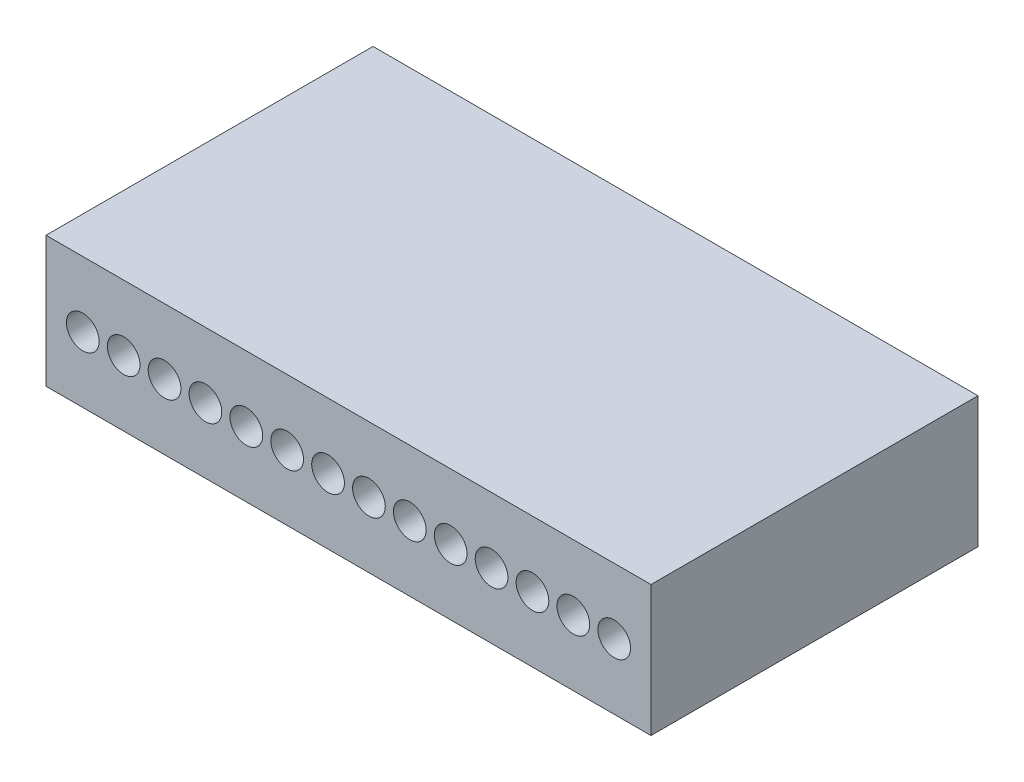
ISO-10303-21;
HEADER;
FILE_DESCRIPTION(('STEP AP214'),'2;1');
FILE_NAME('part.step','',(''),(''),'','','');
FILE_SCHEMA(('AUTOMOTIVE_DESIGN { 1 0 10303 214 1 1 1 1 }'));
ENDSEC;
DATA;
#1=APPLICATION_CONTEXT('core data for automotive mechanical design processes');
#2=APPLICATION_PROTOCOL_DEFINITION('international standard','automotive_design',2000,#1);
#3=PRODUCT_CONTEXT('',#1,'mechanical');
#4=PRODUCT('Part','Part','',(#3));
#5=PRODUCT_RELATED_PRODUCT_CATEGORY('part','',(#4));
#6=PRODUCT_DEFINITION_FORMATION('','',#4);
#7=PRODUCT_DEFINITION_CONTEXT('part definition',#1,'design');
#8=PRODUCT_DEFINITION('design','',#6,#7);
#9=PRODUCT_DEFINITION_SHAPE('','',#8);
#10=(LENGTH_UNIT() NAMED_UNIT(*) SI_UNIT(.MILLI.,.METRE.));
#11=(NAMED_UNIT(*) PLANE_ANGLE_UNIT() SI_UNIT($,.RADIAN.));
#12=(NAMED_UNIT(*) SI_UNIT($,.STERADIAN.) SOLID_ANGLE_UNIT());
#13=UNCERTAINTY_MEASURE_WITH_UNIT(LENGTH_MEASURE(1.E-05),#10,'distance_accuracy_value','');
#14=(GEOMETRIC_REPRESENTATION_CONTEXT(3) GLOBAL_UNCERTAINTY_ASSIGNED_CONTEXT((#13)) GLOBAL_UNIT_ASSIGNED_CONTEXT((#10,
#11,#12)) REPRESENTATION_CONTEXT('',''));
#15=CARTESIAN_POINT('',(0.,0.,0.));
#16=DIRECTION('',(0.,0.,1.));
#17=DIRECTION('',(1.,0.,0.));
#18=AXIS2_PLACEMENT_3D('',#15,#16,#17);
#19=CARTESIAN_POINT('',(0.,0.,10.));
#20=DIRECTION('',(1.,0.,0.));
#21=DIRECTION('',(0.,0.,-1.));
#22=AXIS2_PLACEMENT_3D('',#19,#20,#21);
#23=PLANE('',#22);
#24=DIRECTION('',(0.,-1.,0.));
#25=VECTOR('',#24,1.);
#26=CARTESIAN_POINT('',(0.,0.,0.));
#27=LINE('',#26,#25);
#28=CARTESIAN_POINT('',(0.,4.,0.));
#29=VERTEX_POINT('',#28);
#30=CARTESIAN_POINT('',(0.,0.,0.));
#31=VERTEX_POINT('',#30);
#32=EDGE_CURVE('E107',#29,#31,#27,.T.);
#33=ORIENTED_EDGE('',*,*,#32,.T.);
#34=DIRECTION('',(0.,0.,-1.));
#35=VECTOR('',#34,1.);
#36=CARTESIAN_POINT('',(0.,0.,10.));
#37=LINE('',#36,#35);
#38=CARTESIAN_POINT('',(0.,0.,10.));
#39=VERTEX_POINT('',#38);
#40=EDGE_CURVE('E11',#39,#31,#37,.T.);
#41=ORIENTED_EDGE('',*,*,#40,.F.);
#42=DIRECTION('',(0.,-1.,0.));
#43=VECTOR('',#42,1.);
#44=CARTESIAN_POINT('',(0.,0.,10.));
#45=LINE('',#44,#43);
#46=CARTESIAN_POINT('',(0.,4.,10.));
#47=VERTEX_POINT('',#46);
#48=EDGE_CURVE('E91',#47,#39,#45,.T.);
#49=ORIENTED_EDGE('',*,*,#48,.F.);
#50=DIRECTION('',(0.,0.,-1.));
#51=VECTOR('',#50,1.);
#52=CARTESIAN_POINT('',(0.,4.,10.));
#53=LINE('',#52,#51);
#54=EDGE_CURVE('E103',#47,#29,#53,.T.);
#55=ORIENTED_EDGE('',*,*,#54,.T.);
#56=EDGE_LOOP('',(#33,#41,#49,#55));
#57=FACE_BOUND('',#56,.T.);
#58=ADVANCED_FACE('F39',(#57),#23,.F.);
#59=CARTESIAN_POINT('',(0.,0.,10.));
#60=DIRECTION('',(0.,1.,0.));
#61=DIRECTION('',(0.,0.,1.));
#62=AXIS2_PLACEMENT_3D('',#59,#60,#61);
#63=PLANE('',#62);
#64=DIRECTION('',(1.,0.,0.));
#65=VECTOR('',#64,1.);
#66=CARTESIAN_POINT('',(0.,0.,0.));
#67=LINE('',#66,#65);
#68=CARTESIAN_POINT('',(18.5,0.,0.));
#69=VERTEX_POINT('',#68);
#70=EDGE_CURVE('E96',#31,#69,#67,.T.);
#71=ORIENTED_EDGE('',*,*,#70,.T.);
#72=DIRECTION('',(0.,0.,-1.));
#73=VECTOR('',#72,1.);
#74=CARTESIAN_POINT('',(18.5,0.,10.));
#75=LINE('',#74,#73);
#76=CARTESIAN_POINT('',(18.5,0.,10.));
#77=VERTEX_POINT('',#76);
#78=EDGE_CURVE('E48',#77,#69,#75,.T.);
#79=ORIENTED_EDGE('',*,*,#78,.F.);
#80=DIRECTION('',(1.,0.,0.));
#81=VECTOR('',#80,1.);
#82=CARTESIAN_POINT('',(0.,0.,10.));
#83=LINE('',#82,#81);
#84=EDGE_CURVE('E86',#39,#77,#83,.T.);
#85=ORIENTED_EDGE('',*,*,#84,.F.);
#86=ORIENTED_EDGE('',*,*,#40,.T.);
#87=EDGE_LOOP('',(#71,#79,#85,#86));
#88=FACE_BOUND('',#87,.T.);
#89=ADVANCED_FACE('F95',(#88),#63,.F.);
#90=CARTESIAN_POINT('',(18.5,0.,10.));
#91=DIRECTION('',(-1.,0.,0.));
#92=DIRECTION('',(0.,0.,1.));
#93=AXIS2_PLACEMENT_3D('',#90,#91,#92);
#94=PLANE('',#93);
#95=DIRECTION('',(0.,1.,0.));
#96=VECTOR('',#95,1.);
#97=CARTESIAN_POINT('',(18.5,0.,0.));
#98=LINE('',#97,#96);
#99=CARTESIAN_POINT('',(18.5,4.,0.));
#100=VERTEX_POINT('',#99);
#101=EDGE_CURVE('E73',#69,#100,#98,.T.);
#102=ORIENTED_EDGE('',*,*,#101,.T.);
#103=DIRECTION('',(0.,0.,-1.));
#104=VECTOR('',#103,1.);
#105=CARTESIAN_POINT('',(18.5,4.,10.));
#106=LINE('',#105,#104);
#107=CARTESIAN_POINT('',(18.5,4.,10.));
#108=VERTEX_POINT('',#107);
#109=EDGE_CURVE('E98',#108,#100,#106,.T.);
#110=ORIENTED_EDGE('',*,*,#109,.F.);
#111=DIRECTION('',(0.,1.,0.));
#112=VECTOR('',#111,1.);
#113=CARTESIAN_POINT('',(18.5,0.,10.));
#114=LINE('',#113,#112);
#115=EDGE_CURVE('E89',#77,#108,#114,.T.);
#116=ORIENTED_EDGE('',*,*,#115,.F.);
#117=ORIENTED_EDGE('',*,*,#78,.T.);
#118=EDGE_LOOP('',(#102,#110,#116,#117));
#119=FACE_BOUND('',#118,.T.);
#120=ADVANCED_FACE('F99',(#119),#94,.F.);
#121=CARTESIAN_POINT('',(0.,4.,10.));
#122=DIRECTION('',(0.,-1.,0.));
#123=DIRECTION('',(0.,0.,-1.));
#124=AXIS2_PLACEMENT_3D('',#121,#122,#123);
#125=PLANE('',#124);
#126=DIRECTION('',(-1.,0.,0.));
#127=VECTOR('',#126,1.);
#128=CARTESIAN_POINT('',(0.,4.,0.));
#129=LINE('',#128,#127);
#130=EDGE_CURVE('E79',#100,#29,#129,.T.);
#131=ORIENTED_EDGE('',*,*,#130,.T.);
#132=ORIENTED_EDGE('',*,*,#54,.F.);
#133=DIRECTION('',(-1.,0.,0.));
#134=VECTOR('',#133,1.);
#135=CARTESIAN_POINT('',(0.,4.,10.));
#136=LINE('',#135,#134);
#137=EDGE_CURVE('E56',#108,#47,#136,.T.);
#138=ORIENTED_EDGE('',*,*,#137,.F.);
#139=ORIENTED_EDGE('',*,*,#109,.T.);
#140=EDGE_LOOP('',(#131,#132,#138,#139));
#141=FACE_BOUND('',#140,.T.);
#142=ADVANCED_FACE('F121',(#141),#125,.F.);
#143=CARTESIAN_POINT('',(0.,0.,10.));
#144=DIRECTION('',(0.,0.,-1.));
#145=DIRECTION('',(-1.,0.,0.));
#146=AXIS2_PLACEMENT_3D('',#143,#144,#145);
#147=PLANE('',#146);
#148=CARTESIAN_POINT('',(1.125,2.,10.));
#149=DIRECTION('',(0.,0.,1.));
#150=DIRECTION('',(1.,0.,0.));
#151=AXIS2_PLACEMENT_3D('',#148,#149,#150);
#152=CIRCLE('',#151,0.5);
#153=CARTESIAN_POINT('',(1.625,2.,10.));
#154=VERTEX_POINT('',#153);
#155=EDGE_CURVE('E232',#154,#154,#152,.T.);
#156=ORIENTED_EDGE('',*,*,#155,.F.);
#157=EDGE_LOOP('',(#156));
#158=FACE_BOUND('',#157,.T.);
#159=CARTESIAN_POINT('',(2.375,2.,10.));
#160=DIRECTION('',(0.,0.,1.));
#161=DIRECTION('',(1.,0.,0.));
#162=AXIS2_PLACEMENT_3D('',#159,#160,#161);
#163=CIRCLE('',#162,0.5);
#164=CARTESIAN_POINT('',(2.875,2.,10.));
#165=VERTEX_POINT('',#164);
#166=EDGE_CURVE('E224',#165,#165,#163,.T.);
#167=ORIENTED_EDGE('',*,*,#166,.F.);
#168=EDGE_LOOP('',(#167));
#169=FACE_BOUND('',#168,.T.);
#170=CARTESIAN_POINT('',(3.625,2.,10.));
#171=DIRECTION('',(0.,0.,1.));
#172=DIRECTION('',(1.,0.,0.));
#173=AXIS2_PLACEMENT_3D('',#170,#171,#172);
#174=CIRCLE('',#173,0.5);
#175=CARTESIAN_POINT('',(4.125,2.,10.));
#176=VERTEX_POINT('',#175);
#177=EDGE_CURVE('E216',#176,#176,#174,.T.);
#178=ORIENTED_EDGE('',*,*,#177,.F.);
#179=EDGE_LOOP('',(#178));
#180=FACE_BOUND('',#179,.T.);
#181=CARTESIAN_POINT('',(4.875,2.,10.));
#182=DIRECTION('',(0.,0.,1.));
#183=DIRECTION('',(1.,0.,0.));
#184=AXIS2_PLACEMENT_3D('',#181,#182,#183);
#185=CIRCLE('',#184,0.5);
#186=CARTESIAN_POINT('',(5.375,2.,10.));
#187=VERTEX_POINT('',#186);
#188=EDGE_CURVE('E208',#187,#187,#185,.T.);
#189=ORIENTED_EDGE('',*,*,#188,.F.);
#190=EDGE_LOOP('',(#189));
#191=FACE_BOUND('',#190,.T.);
#192=CARTESIAN_POINT('',(6.125,2.,10.));
#193=DIRECTION('',(0.,0.,1.));
#194=DIRECTION('',(1.,0.,0.));
#195=AXIS2_PLACEMENT_3D('',#192,#193,#194);
#196=CIRCLE('',#195,0.5);
#197=CARTESIAN_POINT('',(6.625,2.,10.));
#198=VERTEX_POINT('',#197);
#199=EDGE_CURVE('E200',#198,#198,#196,.T.);
#200=ORIENTED_EDGE('',*,*,#199,.F.);
#201=EDGE_LOOP('',(#200));
#202=FACE_BOUND('',#201,.T.);
#203=CARTESIAN_POINT('',(7.375,2.,10.));
#204=DIRECTION('',(0.,0.,1.));
#205=DIRECTION('',(1.,0.,0.));
#206=AXIS2_PLACEMENT_3D('',#203,#204,#205);
#207=CIRCLE('',#206,0.500000000000002);
#208=CARTESIAN_POINT('',(7.875,2.,10.));
#209=VERTEX_POINT('',#208);
#210=EDGE_CURVE('E192',#209,#209,#207,.T.);
#211=ORIENTED_EDGE('',*,*,#210,.F.);
#212=EDGE_LOOP('',(#211));
#213=FACE_BOUND('',#212,.T.);
#214=CARTESIAN_POINT('',(8.625,2.,10.));
#215=DIRECTION('',(0.,0.,1.));
#216=DIRECTION('',(1.,0.,0.));
#217=AXIS2_PLACEMENT_3D('',#214,#215,#216);
#218=CIRCLE('',#217,0.499999999999999);
#219=CARTESIAN_POINT('',(9.125,2.,10.));
#220=VERTEX_POINT('',#219);
#221=EDGE_CURVE('E184',#220,#220,#218,.T.);
#222=ORIENTED_EDGE('',*,*,#221,.F.);
#223=EDGE_LOOP('',(#222));
#224=FACE_BOUND('',#223,.T.);
#225=CARTESIAN_POINT('',(9.875,2.,10.));
#226=DIRECTION('',(0.,0.,1.));
#227=DIRECTION('',(1.,0.,0.));
#228=AXIS2_PLACEMENT_3D('',#225,#226,#227);
#229=CIRCLE('',#228,0.499999999999999);
#230=CARTESIAN_POINT('',(10.375,2.,10.));
#231=VERTEX_POINT('',#230);
#232=EDGE_CURVE('E176',#231,#231,#229,.T.);
#233=ORIENTED_EDGE('',*,*,#232,.F.);
#234=EDGE_LOOP('',(#233));
#235=FACE_BOUND('',#234,.T.);
#236=CARTESIAN_POINT('',(11.125,2.,10.));
#237=DIRECTION('',(0.,0.,1.));
#238=DIRECTION('',(1.,0.,0.));
#239=AXIS2_PLACEMENT_3D('',#236,#237,#238);
#240=CIRCLE('',#239,0.499999999999999);
#241=CARTESIAN_POINT('',(11.625,2.,10.));
#242=VERTEX_POINT('',#241);
#243=EDGE_CURVE('E168',#242,#242,#240,.T.);
#244=ORIENTED_EDGE('',*,*,#243,.F.);
#245=EDGE_LOOP('',(#244));
#246=FACE_BOUND('',#245,.T.);
#247=CARTESIAN_POINT('',(12.375,2.,10.));
#248=DIRECTION('',(0.,0.,1.));
#249=DIRECTION('',(1.,0.,0.));
#250=AXIS2_PLACEMENT_3D('',#247,#248,#249);
#251=CIRCLE('',#250,0.499999999999999);
#252=CARTESIAN_POINT('',(12.875,2.,10.));
#253=VERTEX_POINT('',#252);
#254=EDGE_CURVE('E160',#253,#253,#251,.T.);
#255=ORIENTED_EDGE('',*,*,#254,.F.);
#256=EDGE_LOOP('',(#255));
#257=FACE_BOUND('',#256,.T.);
#258=CARTESIAN_POINT('',(13.625,2.,10.));
#259=DIRECTION('',(0.,0.,1.));
#260=DIRECTION('',(1.,0.,0.));
#261=AXIS2_PLACEMENT_3D('',#258,#259,#260);
#262=CIRCLE('',#261,0.499999999999999);
#263=CARTESIAN_POINT('',(14.125,2.,10.));
#264=VERTEX_POINT('',#263);
#265=EDGE_CURVE('E152',#264,#264,#262,.T.);
#266=ORIENTED_EDGE('',*,*,#265,.F.);
#267=EDGE_LOOP('',(#266));
#268=FACE_BOUND('',#267,.T.);
#269=CARTESIAN_POINT('',(14.875,2.,10.));
#270=DIRECTION('',(0.,0.,1.));
#271=DIRECTION('',(1.,0.,0.));
#272=AXIS2_PLACEMENT_3D('',#269,#270,#271);
#273=CIRCLE('',#272,0.499999999999999);
#274=CARTESIAN_POINT('',(15.375,2.,10.));
#275=VERTEX_POINT('',#274);
#276=EDGE_CURVE('E144',#275,#275,#273,.T.);
#277=ORIENTED_EDGE('',*,*,#276,.F.);
#278=EDGE_LOOP('',(#277));
#279=FACE_BOUND('',#278,.T.);
#280=CARTESIAN_POINT('',(16.125,2.,10.));
#281=DIRECTION('',(0.,0.,1.));
#282=DIRECTION('',(1.,0.,0.));
#283=AXIS2_PLACEMENT_3D('',#280,#281,#282);
#284=CIRCLE('',#283,0.499999999999999);
#285=CARTESIAN_POINT('',(16.625,2.,10.));
#286=VERTEX_POINT('',#285);
#287=EDGE_CURVE('E136',#286,#286,#284,.T.);
#288=ORIENTED_EDGE('',*,*,#287,.F.);
#289=EDGE_LOOP('',(#288));
#290=FACE_BOUND('',#289,.T.);
#291=CARTESIAN_POINT('',(17.375,2.,10.));
#292=DIRECTION('',(0.,0.,1.));
#293=DIRECTION('',(1.,0.,0.));
#294=AXIS2_PLACEMENT_3D('',#291,#292,#293);
#295=CIRCLE('',#294,0.499999999999999);
#296=CARTESIAN_POINT('',(17.875,2.,10.));
#297=VERTEX_POINT('',#296);
#298=EDGE_CURVE('E128',#297,#297,#295,.T.);
#299=ORIENTED_EDGE('',*,*,#298,.F.);
#300=EDGE_LOOP('',(#299));
#301=FACE_BOUND('',#300,.T.);
#302=ORIENTED_EDGE('',*,*,#48,.T.);
#303=ORIENTED_EDGE('',*,*,#84,.T.);
#304=ORIENTED_EDGE('',*,*,#115,.T.);
#305=ORIENTED_EDGE('',*,*,#137,.T.);
#306=EDGE_LOOP('',(#302,#303,#304,#305));
#307=FACE_BOUND('',#306,.T.);
#308=ADVANCED_FACE('F87',(#158,#169,#180,#191,#202,#213,#224,#235,#246,#257,#268,#279,#290,#301,
#307),#147,.F.);
#309=CARTESIAN_POINT('',(0.,0.,0.));
#310=DIRECTION('',(0.,0.,-1.));
#311=DIRECTION('',(-1.,0.,0.));
#312=AXIS2_PLACEMENT_3D('',#309,#310,#311);
#313=PLANE('',#312);
#314=ORIENTED_EDGE('',*,*,#32,.F.);
#315=ORIENTED_EDGE('',*,*,#130,.F.);
#316=ORIENTED_EDGE('',*,*,#101,.F.);
#317=ORIENTED_EDGE('',*,*,#70,.F.);
#318=EDGE_LOOP('',(#314,#315,#316,#317));
#319=FACE_BOUND('',#318,.T.);
#320=ADVANCED_FACE('F124',(#319),#313,.T.);
#321=CARTESIAN_POINT('',(17.375,2.,5.));
#322=DIRECTION('',(0.,0.,1.));
#323=DIRECTION('',(1.,0.,0.));
#324=AXIS2_PLACEMENT_3D('',#321,#322,#323);
#325=CYLINDRICAL_SURFACE('',#324,0.499999999999999);
#326=CARTESIAN_POINT('',(17.375,2.,5.));
#327=DIRECTION('',(0.,0.,1.));
#328=DIRECTION('',(1.,0.,0.));
#329=AXIS2_PLACEMENT_3D('',#326,#327,#328);
#330=CIRCLE('',#329,0.499999999999999);
#331=CARTESIAN_POINT('',(17.875,2.,5.));
#332=VERTEX_POINT('',#331);
#333=EDGE_CURVE('E132',#332,#332,#330,.T.);
#334=ORIENTED_EDGE('',*,*,#333,.F.);
#335=EDGE_LOOP('',(#334));
#336=FACE_BOUND('',#335,.T.);
#337=ORIENTED_EDGE('',*,*,#298,.T.);
#338=EDGE_LOOP('',(#337));
#339=FACE_BOUND('',#338,.T.);
#340=ADVANCED_FACE('F278',(#336,#339),#325,.F.);
#341=CARTESIAN_POINT('',(17.375,2.,5.));
#342=DIRECTION('',(0.,0.,1.));
#343=DIRECTION('',(1.,0.,0.));
#344=AXIS2_PLACEMENT_3D('',#341,#342,#343);
#345=PLANE('',#344);
#346=ORIENTED_EDGE('',*,*,#333,.T.);
#347=EDGE_LOOP('',(#346));
#348=FACE_BOUND('',#347,.T.);
#349=ADVANCED_FACE('F280',(#348),#345,.T.);
#350=CARTESIAN_POINT('',(16.125,2.,5.));
#351=DIRECTION('',(0.,0.,1.));
#352=DIRECTION('',(1.,0.,0.));
#353=AXIS2_PLACEMENT_3D('',#350,#351,#352);
#354=CYLINDRICAL_SURFACE('',#353,0.499999999999999);
#355=CARTESIAN_POINT('',(16.125,2.,5.));
#356=DIRECTION('',(0.,0.,1.));
#357=DIRECTION('',(1.,0.,0.));
#358=AXIS2_PLACEMENT_3D('',#355,#356,#357);
#359=CIRCLE('',#358,0.499999999999999);
#360=CARTESIAN_POINT('',(16.625,2.,5.));
#361=VERTEX_POINT('',#360);
#362=EDGE_CURVE('E140',#361,#361,#359,.T.);
#363=ORIENTED_EDGE('',*,*,#362,.F.);
#364=EDGE_LOOP('',(#363));
#365=FACE_BOUND('',#364,.T.);
#366=ORIENTED_EDGE('',*,*,#287,.T.);
#367=EDGE_LOOP('',(#366));
#368=FACE_BOUND('',#367,.T.);
#369=ADVANCED_FACE('F287',(#365,#368),#354,.F.);
#370=CARTESIAN_POINT('',(16.125,2.,5.));
#371=DIRECTION('',(0.,0.,1.));
#372=DIRECTION('',(1.,0.,0.));
#373=AXIS2_PLACEMENT_3D('',#370,#371,#372);
#374=PLANE('',#373);
#375=ORIENTED_EDGE('',*,*,#362,.T.);
#376=EDGE_LOOP('',(#375));
#377=FACE_BOUND('',#376,.T.);
#378=ADVANCED_FACE('F335',(#377),#374,.T.);
#379=CARTESIAN_POINT('',(14.875,2.,5.));
#380=DIRECTION('',(0.,0.,1.));
#381=DIRECTION('',(1.,0.,0.));
#382=AXIS2_PLACEMENT_3D('',#379,#380,#381);
#383=CYLINDRICAL_SURFACE('',#382,0.499999999999999);
#384=CARTESIAN_POINT('',(14.875,2.,5.));
#385=DIRECTION('',(0.,0.,1.));
#386=DIRECTION('',(1.,0.,0.));
#387=AXIS2_PLACEMENT_3D('',#384,#385,#386);
#388=CIRCLE('',#387,0.499999999999999);
#389=CARTESIAN_POINT('',(15.375,2.,5.));
#390=VERTEX_POINT('',#389);
#391=EDGE_CURVE('E148',#390,#390,#388,.T.);
#392=ORIENTED_EDGE('',*,*,#391,.F.);
#393=EDGE_LOOP('',(#392));
#394=FACE_BOUND('',#393,.T.);
#395=ORIENTED_EDGE('',*,*,#276,.T.);
#396=EDGE_LOOP('',(#395));
#397=FACE_BOUND('',#396,.T.);
#398=ADVANCED_FACE('F344',(#394,#397),#383,.F.);
#399=CARTESIAN_POINT('',(14.875,2.,5.));
#400=DIRECTION('',(0.,0.,1.));
#401=DIRECTION('',(1.,0.,0.));
#402=AXIS2_PLACEMENT_3D('',#399,#400,#401);
#403=PLANE('',#402);
#404=ORIENTED_EDGE('',*,*,#391,.T.);
#405=EDGE_LOOP('',(#404));
#406=FACE_BOUND('',#405,.T.);
#407=ADVANCED_FACE('F353',(#406),#403,.T.);
#408=CARTESIAN_POINT('',(13.625,2.,5.));
#409=DIRECTION('',(0.,0.,1.));
#410=DIRECTION('',(1.,0.,0.));
#411=AXIS2_PLACEMENT_3D('',#408,#409,#410);
#412=CYLINDRICAL_SURFACE('',#411,0.499999999999999);
#413=CARTESIAN_POINT('',(13.625,2.,5.));
#414=DIRECTION('',(0.,0.,1.));
#415=DIRECTION('',(1.,0.,0.));
#416=AXIS2_PLACEMENT_3D('',#413,#414,#415);
#417=CIRCLE('',#416,0.499999999999999);
#418=CARTESIAN_POINT('',(14.125,2.,5.));
#419=VERTEX_POINT('',#418);
#420=EDGE_CURVE('E156',#419,#419,#417,.T.);
#421=ORIENTED_EDGE('',*,*,#420,.F.);
#422=EDGE_LOOP('',(#421));
#423=FACE_BOUND('',#422,.T.);
#424=ORIENTED_EDGE('',*,*,#265,.T.);
#425=EDGE_LOOP('',(#424));
#426=FACE_BOUND('',#425,.T.);
#427=ADVANCED_FACE('F362',(#423,#426),#412,.F.);
#428=CARTESIAN_POINT('',(13.625,2.,5.));
#429=DIRECTION('',(0.,0.,1.));
#430=DIRECTION('',(1.,0.,0.));
#431=AXIS2_PLACEMENT_3D('',#428,#429,#430);
#432=PLANE('',#431);
#433=ORIENTED_EDGE('',*,*,#420,.T.);
#434=EDGE_LOOP('',(#433));
#435=FACE_BOUND('',#434,.T.);
#436=ADVANCED_FACE('F371',(#435),#432,.T.);
#437=CARTESIAN_POINT('',(12.375,2.,5.));
#438=DIRECTION('',(0.,0.,1.));
#439=DIRECTION('',(1.,0.,0.));
#440=AXIS2_PLACEMENT_3D('',#437,#438,#439);
#441=CYLINDRICAL_SURFACE('',#440,0.499999999999999);
#442=CARTESIAN_POINT('',(12.375,2.,5.));
#443=DIRECTION('',(0.,0.,1.));
#444=DIRECTION('',(1.,0.,0.));
#445=AXIS2_PLACEMENT_3D('',#442,#443,#444);
#446=CIRCLE('',#445,0.499999999999999);
#447=CARTESIAN_POINT('',(12.875,2.,5.));
#448=VERTEX_POINT('',#447);
#449=EDGE_CURVE('E164',#448,#448,#446,.T.);
#450=ORIENTED_EDGE('',*,*,#449,.F.);
#451=EDGE_LOOP('',(#450));
#452=FACE_BOUND('',#451,.T.);
#453=ORIENTED_EDGE('',*,*,#254,.T.);
#454=EDGE_LOOP('',(#453));
#455=FACE_BOUND('',#454,.T.);
#456=ADVANCED_FACE('F380',(#452,#455),#441,.F.);
#457=CARTESIAN_POINT('',(12.375,2.,5.));
#458=DIRECTION('',(0.,0.,1.));
#459=DIRECTION('',(1.,0.,0.));
#460=AXIS2_PLACEMENT_3D('',#457,#458,#459);
#461=PLANE('',#460);
#462=ORIENTED_EDGE('',*,*,#449,.T.);
#463=EDGE_LOOP('',(#462));
#464=FACE_BOUND('',#463,.T.);
#465=ADVANCED_FACE('F389',(#464),#461,.T.);
#466=CARTESIAN_POINT('',(11.125,2.,5.));
#467=DIRECTION('',(0.,0.,1.));
#468=DIRECTION('',(1.,0.,0.));
#469=AXIS2_PLACEMENT_3D('',#466,#467,#468);
#470=CYLINDRICAL_SURFACE('',#469,0.499999999999999);
#471=CARTESIAN_POINT('',(11.125,2.,5.));
#472=DIRECTION('',(0.,0.,1.));
#473=DIRECTION('',(1.,0.,0.));
#474=AXIS2_PLACEMENT_3D('',#471,#472,#473);
#475=CIRCLE('',#474,0.499999999999999);
#476=CARTESIAN_POINT('',(11.625,2.,5.));
#477=VERTEX_POINT('',#476);
#478=EDGE_CURVE('E172',#477,#477,#475,.T.);
#479=ORIENTED_EDGE('',*,*,#478,.F.);
#480=EDGE_LOOP('',(#479));
#481=FACE_BOUND('',#480,.T.);
#482=ORIENTED_EDGE('',*,*,#243,.T.);
#483=EDGE_LOOP('',(#482));
#484=FACE_BOUND('',#483,.T.);
#485=ADVANCED_FACE('F398',(#481,#484),#470,.F.);
#486=CARTESIAN_POINT('',(11.125,2.,5.));
#487=DIRECTION('',(0.,0.,1.));
#488=DIRECTION('',(1.,0.,0.));
#489=AXIS2_PLACEMENT_3D('',#486,#487,#488);
#490=PLANE('',#489);
#491=ORIENTED_EDGE('',*,*,#478,.T.);
#492=EDGE_LOOP('',(#491));
#493=FACE_BOUND('',#492,.T.);
#494=ADVANCED_FACE('F407',(#493),#490,.T.);
#495=CARTESIAN_POINT('',(9.875,2.,5.));
#496=DIRECTION('',(0.,0.,1.));
#497=DIRECTION('',(1.,0.,0.));
#498=AXIS2_PLACEMENT_3D('',#495,#496,#497);
#499=CYLINDRICAL_SURFACE('',#498,0.499999999999999);
#500=CARTESIAN_POINT('',(9.875,2.,5.));
#501=DIRECTION('',(0.,0.,1.));
#502=DIRECTION('',(1.,0.,0.));
#503=AXIS2_PLACEMENT_3D('',#500,#501,#502);
#504=CIRCLE('',#503,0.499999999999999);
#505=CARTESIAN_POINT('',(10.375,2.,5.));
#506=VERTEX_POINT('',#505);
#507=EDGE_CURVE('E180',#506,#506,#504,.T.);
#508=ORIENTED_EDGE('',*,*,#507,.F.);
#509=EDGE_LOOP('',(#508));
#510=FACE_BOUND('',#509,.T.);
#511=ORIENTED_EDGE('',*,*,#232,.T.);
#512=EDGE_LOOP('',(#511));
#513=FACE_BOUND('',#512,.T.);
#514=ADVANCED_FACE('F416',(#510,#513),#499,.F.);
#515=CARTESIAN_POINT('',(9.875,2.,5.));
#516=DIRECTION('',(0.,0.,1.));
#517=DIRECTION('',(1.,0.,0.));
#518=AXIS2_PLACEMENT_3D('',#515,#516,#517);
#519=PLANE('',#518);
#520=ORIENTED_EDGE('',*,*,#507,.T.);
#521=EDGE_LOOP('',(#520));
#522=FACE_BOUND('',#521,.T.);
#523=ADVANCED_FACE('F425',(#522),#519,.T.);
#524=CARTESIAN_POINT('',(8.625,2.,5.));
#525=DIRECTION('',(0.,0.,1.));
#526=DIRECTION('',(1.,0.,0.));
#527=AXIS2_PLACEMENT_3D('',#524,#525,#526);
#528=CYLINDRICAL_SURFACE('',#527,0.499999999999999);
#529=CARTESIAN_POINT('',(8.625,2.,5.));
#530=DIRECTION('',(0.,0.,1.));
#531=DIRECTION('',(1.,0.,0.));
#532=AXIS2_PLACEMENT_3D('',#529,#530,#531);
#533=CIRCLE('',#532,0.499999999999999);
#534=CARTESIAN_POINT('',(9.125,2.,5.));
#535=VERTEX_POINT('',#534);
#536=EDGE_CURVE('E188',#535,#535,#533,.T.);
#537=ORIENTED_EDGE('',*,*,#536,.F.);
#538=EDGE_LOOP('',(#537));
#539=FACE_BOUND('',#538,.T.);
#540=ORIENTED_EDGE('',*,*,#221,.T.);
#541=EDGE_LOOP('',(#540));
#542=FACE_BOUND('',#541,.T.);
#543=ADVANCED_FACE('F434',(#539,#542),#528,.F.);
#544=CARTESIAN_POINT('',(8.625,2.,5.));
#545=DIRECTION('',(0.,0.,1.));
#546=DIRECTION('',(1.,0.,0.));
#547=AXIS2_PLACEMENT_3D('',#544,#545,#546);
#548=PLANE('',#547);
#549=ORIENTED_EDGE('',*,*,#536,.T.);
#550=EDGE_LOOP('',(#549));
#551=FACE_BOUND('',#550,.T.);
#552=ADVANCED_FACE('F443',(#551),#548,.T.);
#553=CARTESIAN_POINT('',(7.375,2.,5.));
#554=DIRECTION('',(0.,0.,1.));
#555=DIRECTION('',(1.,0.,0.));
#556=AXIS2_PLACEMENT_3D('',#553,#554,#555);
#557=CYLINDRICAL_SURFACE('',#556,0.500000000000002);
#558=CARTESIAN_POINT('',(7.375,2.,5.));
#559=DIRECTION('',(0.,0.,1.));
#560=DIRECTION('',(1.,0.,0.));
#561=AXIS2_PLACEMENT_3D('',#558,#559,#560);
#562=CIRCLE('',#561,0.500000000000002);
#563=CARTESIAN_POINT('',(7.875,2.,5.));
#564=VERTEX_POINT('',#563);
#565=EDGE_CURVE('E196',#564,#564,#562,.T.);
#566=ORIENTED_EDGE('',*,*,#565,.F.);
#567=EDGE_LOOP('',(#566));
#568=FACE_BOUND('',#567,.T.);
#569=ORIENTED_EDGE('',*,*,#210,.T.);
#570=EDGE_LOOP('',(#569));
#571=FACE_BOUND('',#570,.T.);
#572=ADVANCED_FACE('F452',(#568,#571),#557,.F.);
#573=CARTESIAN_POINT('',(7.375,2.,5.));
#574=DIRECTION('',(0.,0.,1.));
#575=DIRECTION('',(1.,0.,0.));
#576=AXIS2_PLACEMENT_3D('',#573,#574,#575);
#577=PLANE('',#576);
#578=ORIENTED_EDGE('',*,*,#565,.T.);
#579=EDGE_LOOP('',(#578));
#580=FACE_BOUND('',#579,.T.);
#581=ADVANCED_FACE('F461',(#580),#577,.T.);
#582=CARTESIAN_POINT('',(6.125,2.,5.));
#583=DIRECTION('',(0.,0.,1.));
#584=DIRECTION('',(1.,0.,0.));
#585=AXIS2_PLACEMENT_3D('',#582,#583,#584);
#586=CYLINDRICAL_SURFACE('',#585,0.5);
#587=CARTESIAN_POINT('',(6.125,2.,5.));
#588=DIRECTION('',(0.,0.,1.));
#589=DIRECTION('',(1.,0.,0.));
#590=AXIS2_PLACEMENT_3D('',#587,#588,#589);
#591=CIRCLE('',#590,0.5);
#592=CARTESIAN_POINT('',(6.625,2.,5.));
#593=VERTEX_POINT('',#592);
#594=EDGE_CURVE('E204',#593,#593,#591,.T.);
#595=ORIENTED_EDGE('',*,*,#594,.F.);
#596=EDGE_LOOP('',(#595));
#597=FACE_BOUND('',#596,.T.);
#598=ORIENTED_EDGE('',*,*,#199,.T.);
#599=EDGE_LOOP('',(#598));
#600=FACE_BOUND('',#599,.T.);
#601=ADVANCED_FACE('F470',(#597,#600),#586,.F.);
#602=CARTESIAN_POINT('',(6.125,2.,5.));
#603=DIRECTION('',(0.,0.,1.));
#604=DIRECTION('',(1.,0.,0.));
#605=AXIS2_PLACEMENT_3D('',#602,#603,#604);
#606=PLANE('',#605);
#607=ORIENTED_EDGE('',*,*,#594,.T.);
#608=EDGE_LOOP('',(#607));
#609=FACE_BOUND('',#608,.T.);
#610=ADVANCED_FACE('F479',(#609),#606,.T.);
#611=CARTESIAN_POINT('',(4.875,2.,5.));
#612=DIRECTION('',(0.,0.,1.));
#613=DIRECTION('',(1.,0.,0.));
#614=AXIS2_PLACEMENT_3D('',#611,#612,#613);
#615=CYLINDRICAL_SURFACE('',#614,0.5);
#616=CARTESIAN_POINT('',(4.875,2.,5.));
#617=DIRECTION('',(0.,0.,1.));
#618=DIRECTION('',(1.,0.,0.));
#619=AXIS2_PLACEMENT_3D('',#616,#617,#618);
#620=CIRCLE('',#619,0.5);
#621=CARTESIAN_POINT('',(5.375,2.,5.));
#622=VERTEX_POINT('',#621);
#623=EDGE_CURVE('E212',#622,#622,#620,.T.);
#624=ORIENTED_EDGE('',*,*,#623,.F.);
#625=EDGE_LOOP('',(#624));
#626=FACE_BOUND('',#625,.T.);
#627=ORIENTED_EDGE('',*,*,#188,.T.);
#628=EDGE_LOOP('',(#627));
#629=FACE_BOUND('',#628,.T.);
#630=ADVANCED_FACE('F488',(#626,#629),#615,.F.);
#631=CARTESIAN_POINT('',(4.875,2.,5.));
#632=DIRECTION('',(0.,0.,1.));
#633=DIRECTION('',(1.,0.,0.));
#634=AXIS2_PLACEMENT_3D('',#631,#632,#633);
#635=PLANE('',#634);
#636=ORIENTED_EDGE('',*,*,#623,.T.);
#637=EDGE_LOOP('',(#636));
#638=FACE_BOUND('',#637,.T.);
#639=ADVANCED_FACE('F497',(#638),#635,.T.);
#640=CARTESIAN_POINT('',(3.625,2.,5.));
#641=DIRECTION('',(0.,0.,1.));
#642=DIRECTION('',(1.,0.,0.));
#643=AXIS2_PLACEMENT_3D('',#640,#641,#642);
#644=CYLINDRICAL_SURFACE('',#643,0.5);
#645=CARTESIAN_POINT('',(3.625,2.,5.));
#646=DIRECTION('',(0.,0.,1.));
#647=DIRECTION('',(1.,0.,0.));
#648=AXIS2_PLACEMENT_3D('',#645,#646,#647);
#649=CIRCLE('',#648,0.5);
#650=CARTESIAN_POINT('',(4.125,2.,5.));
#651=VERTEX_POINT('',#650);
#652=EDGE_CURVE('E220',#651,#651,#649,.T.);
#653=ORIENTED_EDGE('',*,*,#652,.F.);
#654=EDGE_LOOP('',(#653));
#655=FACE_BOUND('',#654,.T.);
#656=ORIENTED_EDGE('',*,*,#177,.T.);
#657=EDGE_LOOP('',(#656));
#658=FACE_BOUND('',#657,.T.);
#659=ADVANCED_FACE('F506',(#655,#658),#644,.F.);
#660=CARTESIAN_POINT('',(3.625,2.,5.));
#661=DIRECTION('',(0.,0.,1.));
#662=DIRECTION('',(1.,0.,0.));
#663=AXIS2_PLACEMENT_3D('',#660,#661,#662);
#664=PLANE('',#663);
#665=ORIENTED_EDGE('',*,*,#652,.T.);
#666=EDGE_LOOP('',(#665));
#667=FACE_BOUND('',#666,.T.);
#668=ADVANCED_FACE('F515',(#667),#664,.T.);
#669=CARTESIAN_POINT('',(2.375,2.,5.));
#670=DIRECTION('',(0.,0.,1.));
#671=DIRECTION('',(1.,0.,0.));
#672=AXIS2_PLACEMENT_3D('',#669,#670,#671);
#673=CYLINDRICAL_SURFACE('',#672,0.5);
#674=CARTESIAN_POINT('',(2.375,2.,5.));
#675=DIRECTION('',(0.,0.,1.));
#676=DIRECTION('',(1.,0.,0.));
#677=AXIS2_PLACEMENT_3D('',#674,#675,#676);
#678=CIRCLE('',#677,0.5);
#679=CARTESIAN_POINT('',(2.875,2.,5.));
#680=VERTEX_POINT('',#679);
#681=EDGE_CURVE('E228',#680,#680,#678,.T.);
#682=ORIENTED_EDGE('',*,*,#681,.F.);
#683=EDGE_LOOP('',(#682));
#684=FACE_BOUND('',#683,.T.);
#685=ORIENTED_EDGE('',*,*,#166,.T.);
#686=EDGE_LOOP('',(#685));
#687=FACE_BOUND('',#686,.T.);
#688=ADVANCED_FACE('F524',(#684,#687),#673,.F.);
#689=CARTESIAN_POINT('',(2.375,2.,5.));
#690=DIRECTION('',(0.,0.,1.));
#691=DIRECTION('',(1.,0.,0.));
#692=AXIS2_PLACEMENT_3D('',#689,#690,#691);
#693=PLANE('',#692);
#694=ORIENTED_EDGE('',*,*,#681,.T.);
#695=EDGE_LOOP('',(#694));
#696=FACE_BOUND('',#695,.T.);
#697=ADVANCED_FACE('F245',(#696),#693,.T.);
#698=CARTESIAN_POINT('',(1.125,2.,5.));
#699=DIRECTION('',(0.,0.,1.));
#700=DIRECTION('',(1.,0.,0.));
#701=AXIS2_PLACEMENT_3D('',#698,#699,#700);
#702=CYLINDRICAL_SURFACE('',#701,0.5);
#703=CARTESIAN_POINT('',(1.125,2.,5.));
#704=DIRECTION('',(0.,0.,1.));
#705=DIRECTION('',(1.,0.,0.));
#706=AXIS2_PLACEMENT_3D('',#703,#704,#705);
#707=CIRCLE('',#706,0.5);
#708=CARTESIAN_POINT('',(1.625,2.,5.));
#709=VERTEX_POINT('',#708);
#710=EDGE_CURVE('E111',#709,#709,#707,.T.);
#711=ORIENTED_EDGE('',*,*,#710,.F.);
#712=EDGE_LOOP('',(#711));
#713=FACE_BOUND('',#712,.T.);
#714=ORIENTED_EDGE('',*,*,#155,.T.);
#715=EDGE_LOOP('',(#714));
#716=FACE_BOUND('',#715,.T.);
#717=ADVANCED_FACE('F242',(#713,#716),#702,.F.);
#718=CARTESIAN_POINT('',(1.125,2.,5.));
#719=DIRECTION('',(0.,0.,1.));
#720=DIRECTION('',(1.,0.,0.));
#721=AXIS2_PLACEMENT_3D('',#718,#719,#720);
#722=PLANE('',#721);
#723=ORIENTED_EDGE('',*,*,#710,.T.);
#724=EDGE_LOOP('',(#723));
#725=FACE_BOUND('',#724,.T.);
#726=ADVANCED_FACE('F240',(#725),#722,.T.);
#727=CLOSED_SHELL('',(#58,#89,#120,#142,#308,#320,#340,#349,#369,#378,#398,#407,#427,#436,#456,
#465,#485,#494,#514,#523,#543,#552,#572,#581,#601,#610,#630,#639,#659,#668,#688,#697,#717,#726));
#728=MANIFOLD_SOLID_BREP('B2',#727);
#729=ADVANCED_BREP_SHAPE_REPRESENTATION('',(#18,#728),#14);
#730=SHAPE_DEFINITION_REPRESENTATION(#9,#729);
ENDSEC;
END-ISO-10303-21;
